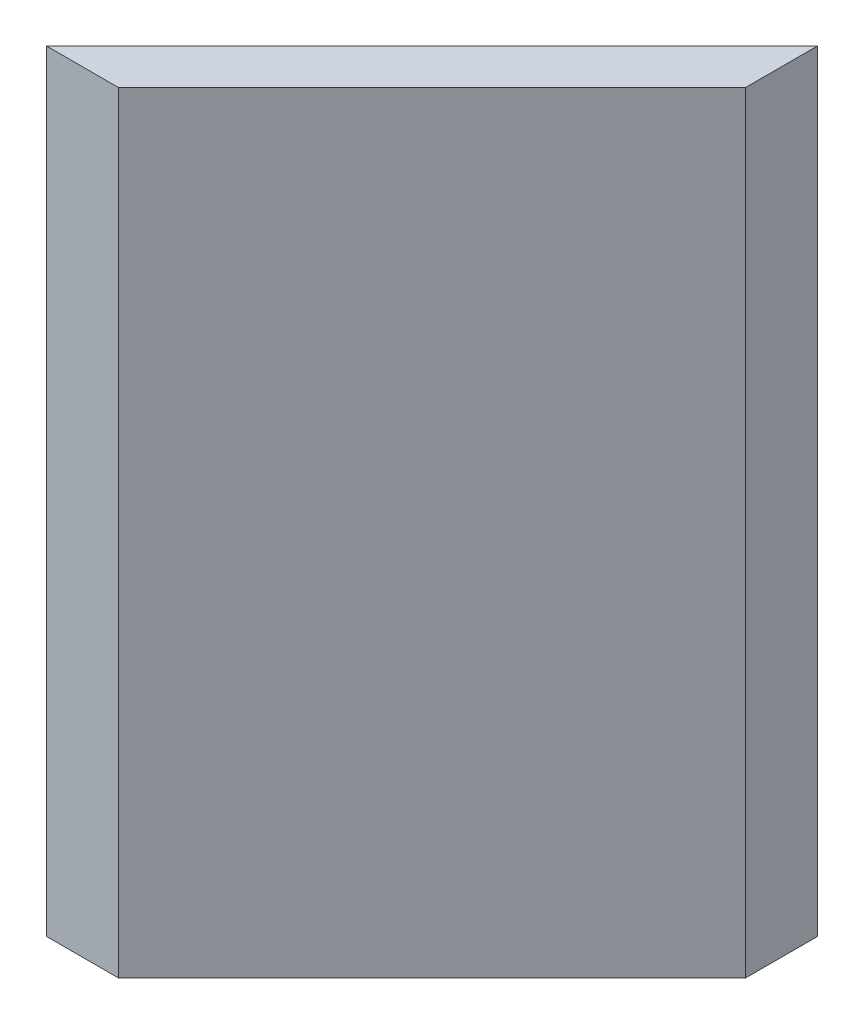
ISO-10303-21;
HEADER;
FILE_DESCRIPTION(('STEP AP214'),'2;1');
FILE_NAME('part.step','',(''),(''),'','','');
FILE_SCHEMA(('AUTOMOTIVE_DESIGN { 1 0 10303 214 1 1 1 1 }'));
ENDSEC;
DATA;
#1=APPLICATION_CONTEXT('core data for automotive mechanical design processes');
#2=APPLICATION_PROTOCOL_DEFINITION('international standard','automotive_design',2000,#1);
#3=PRODUCT_CONTEXT('',#1,'mechanical');
#4=PRODUCT('Part','Part','',(#3));
#5=PRODUCT_RELATED_PRODUCT_CATEGORY('part','',(#4));
#6=PRODUCT_DEFINITION_FORMATION('','',#4);
#7=PRODUCT_DEFINITION_CONTEXT('part definition',#1,'design');
#8=PRODUCT_DEFINITION('design','',#6,#7);
#9=PRODUCT_DEFINITION_SHAPE('','',#8);
#10=(LENGTH_UNIT() NAMED_UNIT(*) SI_UNIT(.MILLI.,.METRE.));
#11=(NAMED_UNIT(*) PLANE_ANGLE_UNIT() SI_UNIT($,.RADIAN.));
#12=(NAMED_UNIT(*) SI_UNIT($,.STERADIAN.) SOLID_ANGLE_UNIT());
#13=UNCERTAINTY_MEASURE_WITH_UNIT(LENGTH_MEASURE(1.E-05),#10,'distance_accuracy_value','');
#14=(GEOMETRIC_REPRESENTATION_CONTEXT(3) GLOBAL_UNCERTAINTY_ASSIGNED_CONTEXT((#13)) GLOBAL_UNIT_ASSIGNED_CONTEXT((#10,
#11,#12)) REPRESENTATION_CONTEXT('',''));
#15=CARTESIAN_POINT('',(0.,0.,0.));
#16=DIRECTION('',(0.,0.,1.));
#17=DIRECTION('',(1.,0.,0.));
#18=AXIS2_PLACEMENT_3D('',#15,#16,#17);
#19=CARTESIAN_POINT('',(-90.9705627484771,182.,0.));
#20=DIRECTION('',(0.,0.,-1.));
#21=DIRECTION('',(-1.,0.,0.));
#22=AXIS2_PLACEMENT_3D('',#19,#20,#21);
#23=PLANE('',#22);
#24=DIRECTION('',(1.,0.,0.));
#25=VECTOR('',#24,1.);
#26=CARTESIAN_POINT('',(-90.9705627484771,0.,0.));
#27=LINE('',#26,#25);
#28=CARTESIAN_POINT('',(-90.9705627484771,0.,0.));
#29=VERTEX_POINT('',#28);
#30=CARTESIAN_POINT('',(-74.,0.,0.));
#31=VERTEX_POINT('',#30);
#32=EDGE_CURVE('E95',#29,#31,#27,.T.);
#33=ORIENTED_EDGE('',*,*,#32,.T.);
#34=DIRECTION('',(0.,-1.,0.));
#35=VECTOR('',#34,1.);
#36=CARTESIAN_POINT('',(-74.,182.,0.));
#37=LINE('',#36,#35);
#38=CARTESIAN_POINT('',(-74.,182.,0.));
#39=VERTEX_POINT('',#38);
#40=EDGE_CURVE('E11',#39,#31,#37,.T.);
#41=ORIENTED_EDGE('',*,*,#40,.F.);
#42=DIRECTION('',(1.,0.,0.));
#43=VECTOR('',#42,1.);
#44=CARTESIAN_POINT('',(-90.9705627484771,182.,0.));
#45=LINE('',#44,#43);
#46=CARTESIAN_POINT('',(-90.9705627484771,182.,0.));
#47=VERTEX_POINT('',#46);
#48=EDGE_CURVE('E83',#47,#39,#45,.T.);
#49=ORIENTED_EDGE('',*,*,#48,.F.);
#50=DIRECTION('',(0.,-1.,0.));
#51=VECTOR('',#50,1.);
#52=CARTESIAN_POINT('',(-90.9705627484771,182.,0.));
#53=LINE('',#52,#51);
#54=EDGE_CURVE('E91',#47,#29,#53,.T.);
#55=ORIENTED_EDGE('',*,*,#54,.T.);
#56=EDGE_LOOP('',(#33,#41,#49,#55));
#57=FACE_BOUND('',#56,.T.);
#58=ADVANCED_FACE('F32',(#57),#23,.F.);
#59=CARTESIAN_POINT('',(-74.,182.,0.));
#60=DIRECTION('',(-0.707106781186548,0.,-0.707106781186547));
#61=DIRECTION('',(-0.707106781186547,0.,0.707106781186548));
#62=AXIS2_PLACEMENT_3D('',#59,#60,#61);
#63=PLANE('',#62);
#64=DIRECTION('',(0.707106781186547,0.,-0.707106781186548));
#65=VECTOR('',#64,1.);
#66=CARTESIAN_POINT('',(-74.,0.,0.));
#67=LINE('',#66,#65);
#68=CARTESIAN_POINT('',(0.,0.,-74.));
#69=VERTEX_POINT('',#68);
#70=EDGE_CURVE('E87',#31,#69,#67,.T.);
#71=ORIENTED_EDGE('',*,*,#70,.T.);
#72=DIRECTION('',(0.,-1.,0.));
#73=VECTOR('',#72,1.);
#74=CARTESIAN_POINT('',(0.,182.,-74.));
#75=LINE('',#74,#73);
#76=CARTESIAN_POINT('',(0.,182.,-74.));
#77=VERTEX_POINT('',#76);
#78=EDGE_CURVE('E40',#77,#69,#75,.T.);
#79=ORIENTED_EDGE('',*,*,#78,.F.);
#80=DIRECTION('',(0.707106781186547,0.,-0.707106781186548));
#81=VECTOR('',#80,1.);
#82=CARTESIAN_POINT('',(-74.,182.,0.));
#83=LINE('',#82,#81);
#84=EDGE_CURVE('E78',#39,#77,#83,.T.);
#85=ORIENTED_EDGE('',*,*,#84,.F.);
#86=ORIENTED_EDGE('',*,*,#40,.T.);
#87=EDGE_LOOP('',(#71,#79,#85,#86));
#88=FACE_BOUND('',#87,.T.);
#89=ADVANCED_FACE('F86',(#88),#63,.F.);
#90=CARTESIAN_POINT('',(0.,182.,-74.));
#91=DIRECTION('',(-1.,0.,0.));
#92=DIRECTION('',(0.,0.,1.));
#93=AXIS2_PLACEMENT_3D('',#90,#91,#92);
#94=PLANE('',#93);
#95=DIRECTION('',(0.,0.,-1.));
#96=VECTOR('',#95,1.);
#97=CARTESIAN_POINT('',(0.,0.,-74.));
#98=LINE('',#97,#96);
#99=CARTESIAN_POINT('',(0.,0.,-90.9705627484771));
#100=VERTEX_POINT('',#99);
#101=EDGE_CURVE('E65',#69,#100,#98,.T.);
#102=ORIENTED_EDGE('',*,*,#101,.T.);
#103=DIRECTION('',(0.,-1.,0.));
#104=VECTOR('',#103,1.);
#105=CARTESIAN_POINT('',(0.,182.,-90.9705627484771));
#106=LINE('',#105,#104);
#107=CARTESIAN_POINT('',(0.,182.,-90.9705627484771));
#108=VERTEX_POINT('',#107);
#109=EDGE_CURVE('E88',#108,#100,#106,.T.);
#110=ORIENTED_EDGE('',*,*,#109,.F.);
#111=DIRECTION('',(0.,0.,-1.));
#112=VECTOR('',#111,1.);
#113=CARTESIAN_POINT('',(0.,182.,-74.));
#114=LINE('',#113,#112);
#115=EDGE_CURVE('E81',#77,#108,#114,.T.);
#116=ORIENTED_EDGE('',*,*,#115,.F.);
#117=ORIENTED_EDGE('',*,*,#78,.T.);
#118=EDGE_LOOP('',(#102,#110,#116,#117));
#119=FACE_BOUND('',#118,.T.);
#120=ADVANCED_FACE('F89',(#119),#94,.F.);
#121=CARTESIAN_POINT('',(0.,182.,-90.9705627484771));
#122=DIRECTION('',(0.707106781186547,0.,0.707106781186547));
#123=DIRECTION('',(0.707106781186548,0.,-0.707106781186548));
#124=AXIS2_PLACEMENT_3D('',#121,#122,#123);
#125=PLANE('',#124);
#126=DIRECTION('',(-0.707106781186547,0.,0.707106781186547));
#127=VECTOR('',#126,1.);
#128=CARTESIAN_POINT('',(0.,0.,-90.9705627484771));
#129=LINE('',#128,#127);
#130=EDGE_CURVE('E71',#100,#29,#129,.T.);
#131=ORIENTED_EDGE('',*,*,#130,.T.);
#132=ORIENTED_EDGE('',*,*,#54,.F.);
#133=DIRECTION('',(-0.707106781186547,0.,0.707106781186547));
#134=VECTOR('',#133,1.);
#135=CARTESIAN_POINT('',(0.,182.,-90.9705627484771));
#136=LINE('',#135,#134);
#137=EDGE_CURVE('E48',#108,#47,#136,.T.);
#138=ORIENTED_EDGE('',*,*,#137,.F.);
#139=ORIENTED_EDGE('',*,*,#109,.T.);
#140=EDGE_LOOP('',(#131,#132,#138,#139));
#141=FACE_BOUND('',#140,.T.);
#142=ADVANCED_FACE('F102',(#141),#125,.F.);
#143=CARTESIAN_POINT('',(0.,182.,0.));
#144=DIRECTION('',(0.,1.,0.));
#145=DIRECTION('',(0.,0.,1.));
#146=AXIS2_PLACEMENT_3D('',#143,#144,#145);
#147=PLANE('',#146);
#148=ORIENTED_EDGE('',*,*,#48,.T.);
#149=ORIENTED_EDGE('',*,*,#84,.T.);
#150=ORIENTED_EDGE('',*,*,#115,.T.);
#151=ORIENTED_EDGE('',*,*,#137,.T.);
#152=EDGE_LOOP('',(#148,#149,#150,#151));
#153=FACE_BOUND('',#152,.T.);
#154=ADVANCED_FACE('F79',(#153),#147,.T.);
#155=CARTESIAN_POINT('',(0.,0.,0.));
#156=DIRECTION('',(0.,1.,0.));
#157=DIRECTION('',(0.,0.,1.));
#158=AXIS2_PLACEMENT_3D('',#155,#156,#157);
#159=PLANE('',#158);
#160=ORIENTED_EDGE('',*,*,#32,.F.);
#161=ORIENTED_EDGE('',*,*,#130,.F.);
#162=ORIENTED_EDGE('',*,*,#101,.F.);
#163=ORIENTED_EDGE('',*,*,#70,.F.);
#164=EDGE_LOOP('',(#160,#161,#162,#163));
#165=FACE_BOUND('',#164,.T.);
#166=ADVANCED_FACE('F105',(#165),#159,.F.);
#167=CLOSED_SHELL('',(#58,#89,#120,#142,#154,#166));
#168=MANIFOLD_SOLID_BREP('B2',#167);
#169=ADVANCED_BREP_SHAPE_REPRESENTATION('',(#18,#168),#14);
#170=SHAPE_DEFINITION_REPRESENTATION(#9,#169);
ENDSEC;
END-ISO-10303-21;
